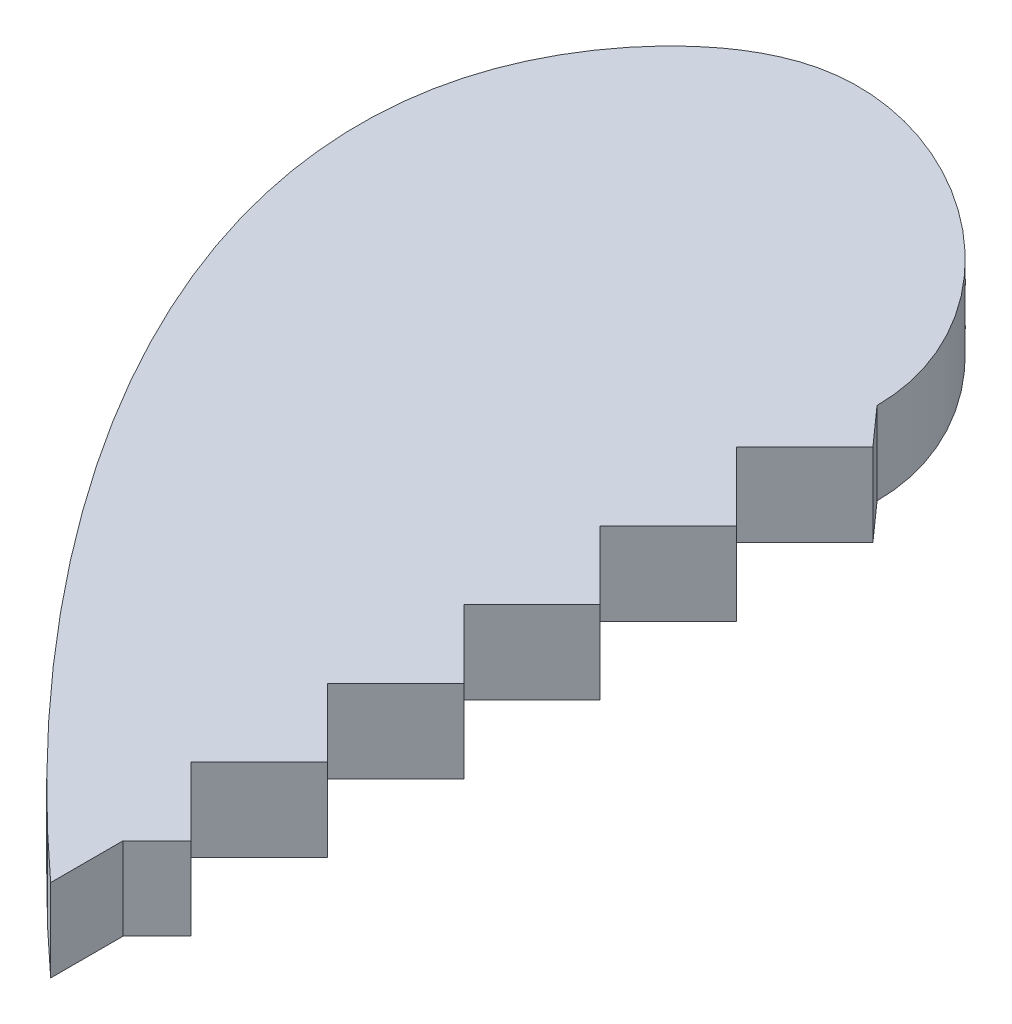
ISO-10303-21;
HEADER;
FILE_DESCRIPTION(('STEP AP214'),'2;1');
FILE_NAME('part.step','',(''),(''),'','','');
FILE_SCHEMA(('AUTOMOTIVE_DESIGN { 1 0 10303 214 1 1 1 1 }'));
ENDSEC;
DATA;
#1=APPLICATION_CONTEXT('core data for automotive mechanical design processes');
#2=APPLICATION_PROTOCOL_DEFINITION('international standard','automotive_design',2000,#1);
#3=PRODUCT_CONTEXT('',#1,'mechanical');
#4=PRODUCT('Part','Part','',(#3));
#5=PRODUCT_RELATED_PRODUCT_CATEGORY('part','',(#4));
#6=PRODUCT_DEFINITION_FORMATION('','',#4);
#7=PRODUCT_DEFINITION_CONTEXT('part definition',#1,'design');
#8=PRODUCT_DEFINITION('design','',#6,#7);
#9=PRODUCT_DEFINITION_SHAPE('','',#8);
#10=(LENGTH_UNIT() NAMED_UNIT(*) SI_UNIT(.MILLI.,.METRE.));
#11=(NAMED_UNIT(*) PLANE_ANGLE_UNIT() SI_UNIT($,.RADIAN.));
#12=(NAMED_UNIT(*) SI_UNIT($,.STERADIAN.) SOLID_ANGLE_UNIT());
#13=UNCERTAINTY_MEASURE_WITH_UNIT(LENGTH_MEASURE(1.E-05),#10,'distance_accuracy_value','');
#14=(GEOMETRIC_REPRESENTATION_CONTEXT(3) GLOBAL_UNCERTAINTY_ASSIGNED_CONTEXT((#13)) GLOBAL_UNIT_ASSIGNED_CONTEXT((#10,
#11,#12)) REPRESENTATION_CONTEXT('',''));
#15=CARTESIAN_POINT('',(0.,0.,0.));
#16=DIRECTION('',(0.,0.,1.));
#17=DIRECTION('',(1.,0.,0.));
#18=AXIS2_PLACEMENT_3D('',#15,#16,#17);
#19=CARTESIAN_POINT('',(0.,3.,-14.0721444758384));
#20=CARTESIAN_POINT('',(0.,3.,-19.24485919675));
#21=CARTESIAN_POINT('',(-9.4205206060751,3.,-26.7563747485701));
#22=CARTESIAN_POINT('',(-24.9137531388097,3.,-13.2721558044756));
#23=CARTESIAN_POINT('',(-11.5329776723601,3.,5.45462345902874));
#24=CARTESIAN_POINT('',(0.,3.,15.9278555241616));
#25=B_SPLINE_CURVE_WITH_KNOTS('',3,(#19,#20,#21,#22,#23,#24),.UNSPECIFIED.,.F.,.F.,(4,1,1,4),
(0.,0.261667033692079,0.361667033692079,1.),.UNSPECIFIED.);
#26=DIRECTION('',(0.,-1.,0.));
#27=VECTOR('',#26,1.);
#28=SURFACE_OF_LINEAR_EXTRUSION('',#25,#27);
#29=CARTESIAN_POINT('',(0.,0.,-14.0721444758384));
#30=CARTESIAN_POINT('',(0.,0.,-19.24485919675));
#31=CARTESIAN_POINT('',(-9.4205206060751,0.,-26.7563747485701));
#32=CARTESIAN_POINT('',(-24.9137531388097,0.,-13.2721558044756));
#33=CARTESIAN_POINT('',(-11.5329776723601,0.,5.45462345902874));
#34=CARTESIAN_POINT('',(0.,0.,15.9278555241616));
#35=B_SPLINE_CURVE_WITH_KNOTS('',3,(#29,#30,#31,#32,#33,#34),.UNSPECIFIED.,.F.,.F.,(4,1,1,4),
(0.,0.261667033692079,0.361667033692079,1.),.UNSPECIFIED.);
#36=CARTESIAN_POINT('',(0.,0.,-14.0721444758384));
#37=VERTEX_POINT('',#36);
#38=CARTESIAN_POINT('',(0.,0.,15.9278555241616));
#39=VERTEX_POINT('',#38);
#40=EDGE_CURVE('E231',#37,#39,#35,.T.);
#41=ORIENTED_EDGE('',*,*,#40,.T.);
#42=DIRECTION('',(0.,-1.,0.));
#43=VECTOR('',#42,1.);
#44=CARTESIAN_POINT('',(0.,3.,15.9278555241616));
#45=LINE('',#44,#43);
#46=CARTESIAN_POINT('',(0.,3.,15.9278555241616));
#47=VERTEX_POINT('',#46);
#48=EDGE_CURVE('E11',#47,#39,#45,.T.);
#49=ORIENTED_EDGE('',*,*,#48,.F.);
#50=CARTESIAN_POINT('',(0.,3.,-14.0721444758384));
#51=VERTEX_POINT('',#50);
#52=EDGE_CURVE('E260',#51,#47,#25,.T.);
#53=ORIENTED_EDGE('',*,*,#52,.F.);
#54=DIRECTION('',(0.,-1.,0.));
#55=VECTOR('',#54,1.);
#56=CARTESIAN_POINT('',(0.,3.,-14.0721444758384));
#57=LINE('',#56,#55);
#58=EDGE_CURVE('E48',#51,#37,#57,.T.);
#59=ORIENTED_EDGE('',*,*,#58,.T.);
#60=EDGE_LOOP('',(#41,#49,#53,#59));
#61=FACE_BOUND('',#60,.T.);
#62=ADVANCED_FACE('F39',(#61),#28,.F.);
#63=CARTESIAN_POINT('',(-18.2335204914853,3.,-13.3078582028131));
#64=DIRECTION('',(0.,-1.,0.));
#65=DIRECTION('',(0.,0.,-1.));
#66=AXIS2_PLACEMENT_3D('',#63,#64,#65);
#67=PLANE('',#66);
#68=ORIENTED_EDGE('',*,*,#52,.T.);
#69=DIRECTION('',(0.,0.,1.));
#70=VECTOR('',#69,1.);
#71=CARTESIAN_POINT('',(0.,3.,13.3022241949262));
#72=LINE('',#71,#70);
#73=CARTESIAN_POINT('',(0.,3.,13.3022241949262));
#74=VERTEX_POINT('',#73);
#75=EDGE_CURVE('E109',#74,#47,#72,.T.);
#76=ORIENTED_EDGE('',*,*,#75,.F.);
#77=DIRECTION('',(-0.707106781186547,0.,0.707106781186548));
#78=VECTOR('',#77,1.);
#79=CARTESIAN_POINT('',(1.23743686707646,3.,12.0647873278497));
#80=LINE('',#79,#78);
#81=CARTESIAN_POINT('',(1.23743686707646,3.,12.0647873278497));
#82=VERTEX_POINT('',#81);
#83=EDGE_CURVE('E225',#82,#74,#80,.T.);
#84=ORIENTED_EDGE('',*,*,#83,.F.);
#85=DIRECTION('',(0.707106781186547,0.,0.707106781186548));
#86=VECTOR('',#85,1.);
#87=CARTESIAN_POINT('',(-1.23743686707646,3.,9.58991359369679));
#88=LINE('',#87,#86);
#89=CARTESIAN_POINT('',(-1.23743686707646,3.,9.58991359369679));
#90=VERTEX_POINT('',#89);
#91=EDGE_CURVE('E154',#90,#82,#88,.T.);
#92=ORIENTED_EDGE('',*,*,#91,.F.);
#93=DIRECTION('',(-0.707106781186547,0.,0.707106781186548));
#94=VECTOR('',#93,1.);
#95=CARTESIAN_POINT('',(1.23743686707646,3.,7.11503985954387));
#96=LINE('',#95,#94);
#97=CARTESIAN_POINT('',(1.23743686707646,3.,7.11503985954387));
#98=VERTEX_POINT('',#97);
#99=EDGE_CURVE('E219',#98,#90,#96,.T.);
#100=ORIENTED_EDGE('',*,*,#99,.F.);
#101=DIRECTION('',(0.707106781186548,0.,0.707106781186548));
#102=VECTOR('',#101,1.);
#103=CARTESIAN_POINT('',(-1.23743686707646,3.,4.64016612539096));
#104=LINE('',#103,#102);
#105=CARTESIAN_POINT('',(-1.23743686707646,3.,4.64016612539096));
#106=VERTEX_POINT('',#105);
#107=EDGE_CURVE('E215',#106,#98,#104,.T.);
#108=ORIENTED_EDGE('',*,*,#107,.F.);
#109=DIRECTION('',(-0.707106781186547,0.,0.707106781186548));
#110=VECTOR('',#109,1.);
#111=CARTESIAN_POINT('',(1.23743686707646,3.,2.16529239123804));
#112=LINE('',#111,#110);
#113=CARTESIAN_POINT('',(1.23743686707646,3.,2.16529239123804));
#114=VERTEX_POINT('',#113);
#115=EDGE_CURVE('E211',#114,#106,#112,.T.);
#116=ORIENTED_EDGE('',*,*,#115,.F.);
#117=DIRECTION('',(0.707106781186547,0.,0.707106781186548));
#118=VECTOR('',#117,1.);
#119=CARTESIAN_POINT('',(-1.23743686707646,3.,-0.30958134291488));
#120=LINE('',#119,#118);
#121=CARTESIAN_POINT('',(-1.23743686707646,3.,-0.30958134291488));
#122=VERTEX_POINT('',#121);
#123=EDGE_CURVE('E207',#122,#114,#120,.T.);
#124=ORIENTED_EDGE('',*,*,#123,.F.);
#125=DIRECTION('',(-0.707106781186547,0.,0.707106781186547));
#126=VECTOR('',#125,1.);
#127=CARTESIAN_POINT('',(1.23743686707646,3.,-2.7844550770678));
#128=LINE('',#127,#126);
#129=CARTESIAN_POINT('',(1.23743686707646,3.,-2.7844550770678));
#130=VERTEX_POINT('',#129);
#131=EDGE_CURVE('E203',#130,#122,#128,.T.);
#132=ORIENTED_EDGE('',*,*,#131,.F.);
#133=DIRECTION('',(0.707106781186548,0.,0.707106781186548));
#134=VECTOR('',#133,1.);
#135=CARTESIAN_POINT('',(-1.23743686707646,3.,-5.25932881122071));
#136=LINE('',#135,#134);
#137=CARTESIAN_POINT('',(-1.23743686707646,3.,-5.25932881122071));
#138=VERTEX_POINT('',#137);
#139=EDGE_CURVE('E199',#138,#130,#136,.T.);
#140=ORIENTED_EDGE('',*,*,#139,.F.);
#141=DIRECTION('',(-0.707106781186548,0.,0.707106781186547));
#142=VECTOR('',#141,1.);
#143=CARTESIAN_POINT('',(1.23743686707646,3.,-7.73420254537363));
#144=LINE('',#143,#142);
#145=CARTESIAN_POINT('',(1.23743686707646,3.,-7.73420254537363));
#146=VERTEX_POINT('',#145);
#147=EDGE_CURVE('E195',#146,#138,#144,.T.);
#148=ORIENTED_EDGE('',*,*,#147,.F.);
#149=DIRECTION('',(0.707106781186548,0.,0.707106781186547));
#150=VECTOR('',#149,1.);
#151=CARTESIAN_POINT('',(-1.23743686707646,3.,-10.2090762795265));
#152=LINE('',#151,#150);
#153=CARTESIAN_POINT('',(-1.23743686707646,3.,-10.2090762795265));
#154=VERTEX_POINT('',#153);
#155=EDGE_CURVE('E191',#154,#146,#152,.T.);
#156=ORIENTED_EDGE('',*,*,#155,.F.);
#157=DIRECTION('',(-0.707106781186547,0.,0.707106781186548));
#158=VECTOR('',#157,1.);
#159=CARTESIAN_POINT('',(1.23743686707646,3.,-12.6839500136795));
#160=LINE('',#159,#158);
#161=CARTESIAN_POINT('',(1.23743686707646,3.,-12.6839500136795));
#162=VERTEX_POINT('',#161);
#163=EDGE_CURVE('E187',#162,#154,#160,.T.);
#164=ORIENTED_EDGE('',*,*,#163,.F.);
#165=DIRECTION('',(0.665410411924532,0.,0.746477718155354));
#166=VECTOR('',#165,1.);
#167=CARTESIAN_POINT('',(0.,3.,-14.0721444758384));
#168=LINE('',#167,#166);
#169=EDGE_CURVE('E183',#51,#162,#168,.T.);
#170=ORIENTED_EDGE('',*,*,#169,.F.);
#171=EDGE_LOOP('',(#68,#76,#84,#92,#100,#108,#116,#124,#132,#140,#148,#156,#164,#170));
#172=FACE_BOUND('',#171,.T.);
#173=ADVANCED_FACE('F283',(#172),#67,.F.);
#174=CARTESIAN_POINT('',(-18.2335204914853,0.,-13.3078582028131));
#175=DIRECTION('',(0.,-1.,0.));
#176=DIRECTION('',(0.,0.,-1.));
#177=AXIS2_PLACEMENT_3D('',#174,#175,#176);
#178=PLANE('',#177);
#179=DIRECTION('',(0.,0.,1.));
#180=VECTOR('',#179,1.);
#181=CARTESIAN_POINT('',(0.,0.,13.3022241949262));
#182=LINE('',#181,#180);
#183=CARTESIAN_POINT('',(0.,0.,13.3022241949262));
#184=VERTEX_POINT('',#183);
#185=EDGE_CURVE('E167',#184,#39,#182,.T.);
#186=ORIENTED_EDGE('',*,*,#185,.T.);
#187=ORIENTED_EDGE('',*,*,#40,.F.);
#188=DIRECTION('',(0.665410411924532,0.,0.746477718155354));
#189=VECTOR('',#188,1.);
#190=CARTESIAN_POINT('',(0.,0.,-14.0721444758384));
#191=LINE('',#190,#189);
#192=CARTESIAN_POINT('',(1.23743686707646,0.,-12.6839500136795));
#193=VERTEX_POINT('',#192);
#194=EDGE_CURVE('E116',#37,#193,#191,.T.);
#195=ORIENTED_EDGE('',*,*,#194,.T.);
#196=DIRECTION('',(-0.707106781186547,0.,0.707106781186548));
#197=VECTOR('',#196,1.);
#198=CARTESIAN_POINT('',(1.23743686707646,0.,-12.6839500136795));
#199=LINE('',#198,#197);
#200=CARTESIAN_POINT('',(-1.23743686707646,0.,-10.2090762795265));
#201=VERTEX_POINT('',#200);
#202=EDGE_CURVE('E55',#193,#201,#199,.T.);
#203=ORIENTED_EDGE('',*,*,#202,.T.);
#204=DIRECTION('',(0.707106781186548,0.,0.707106781186547));
#205=VECTOR('',#204,1.);
#206=CARTESIAN_POINT('',(-1.23743686707646,0.,-10.2090762795265));
#207=LINE('',#206,#205);
#208=CARTESIAN_POINT('',(1.23743686707646,0.,-7.73420254537363));
#209=VERTEX_POINT('',#208);
#210=EDGE_CURVE('E295',#201,#209,#207,.T.);
#211=ORIENTED_EDGE('',*,*,#210,.T.);
#212=DIRECTION('',(-0.707106781186548,0.,0.707106781186547));
#213=VECTOR('',#212,1.);
#214=CARTESIAN_POINT('',(1.23743686707646,0.,-7.73420254537363));
#215=LINE('',#214,#213);
#216=CARTESIAN_POINT('',(-1.23743686707646,0.,-5.25932881122071));
#217=VERTEX_POINT('',#216);
#218=EDGE_CURVE('E298',#209,#217,#215,.T.);
#219=ORIENTED_EDGE('',*,*,#218,.T.);
#220=DIRECTION('',(0.707106781186548,0.,0.707106781186548));
#221=VECTOR('',#220,1.);
#222=CARTESIAN_POINT('',(-1.23743686707646,0.,-5.25932881122071));
#223=LINE('',#222,#221);
#224=CARTESIAN_POINT('',(1.23743686707646,0.,-2.7844550770678));
#225=VERTEX_POINT('',#224);
#226=EDGE_CURVE('E307',#217,#225,#223,.T.);
#227=ORIENTED_EDGE('',*,*,#226,.T.);
#228=DIRECTION('',(-0.707106781186547,0.,0.707106781186547));
#229=VECTOR('',#228,1.);
#230=CARTESIAN_POINT('',(1.23743686707646,0.,-2.7844550770678));
#231=LINE('',#230,#229);
#232=CARTESIAN_POINT('',(-1.23743686707646,0.,-0.30958134291488));
#233=VERTEX_POINT('',#232);
#234=EDGE_CURVE('E311',#225,#233,#231,.T.);
#235=ORIENTED_EDGE('',*,*,#234,.T.);
#236=DIRECTION('',(0.707106781186547,0.,0.707106781186548));
#237=VECTOR('',#236,1.);
#238=CARTESIAN_POINT('',(-1.23743686707646,0.,-0.30958134291488));
#239=LINE('',#238,#237);
#240=CARTESIAN_POINT('',(1.23743686707646,0.,2.16529239123804));
#241=VERTEX_POINT('',#240);
#242=EDGE_CURVE('E315',#233,#241,#239,.T.);
#243=ORIENTED_EDGE('',*,*,#242,.T.);
#244=DIRECTION('',(-0.707106781186547,0.,0.707106781186548));
#245=VECTOR('',#244,1.);
#246=CARTESIAN_POINT('',(1.23743686707646,0.,2.16529239123804));
#247=LINE('',#246,#245);
#248=CARTESIAN_POINT('',(-1.23743686707646,0.,4.64016612539096));
#249=VERTEX_POINT('',#248);
#250=EDGE_CURVE('E319',#241,#249,#247,.T.);
#251=ORIENTED_EDGE('',*,*,#250,.T.);
#252=DIRECTION('',(0.707106781186548,0.,0.707106781186548));
#253=VECTOR('',#252,1.);
#254=CARTESIAN_POINT('',(-1.23743686707646,0.,4.64016612539096));
#255=LINE('',#254,#253);
#256=CARTESIAN_POINT('',(1.23743686707646,0.,7.11503985954387));
#257=VERTEX_POINT('',#256);
#258=EDGE_CURVE('E176',#249,#257,#255,.T.);
#259=ORIENTED_EDGE('',*,*,#258,.T.);
#260=DIRECTION('',(-0.707106781186547,0.,0.707106781186548));
#261=VECTOR('',#260,1.);
#262=CARTESIAN_POINT('',(1.23743686707646,0.,7.11503985954387));
#263=LINE('',#262,#261);
#264=CARTESIAN_POINT('',(-1.23743686707646,0.,9.58991359369679));
#265=VERTEX_POINT('',#264);
#266=EDGE_CURVE('E172',#257,#265,#263,.T.);
#267=ORIENTED_EDGE('',*,*,#266,.T.);
#268=DIRECTION('',(0.707106781186547,0.,0.707106781186548));
#269=VECTOR('',#268,1.);
#270=CARTESIAN_POINT('',(-1.23743686707646,0.,9.58991359369679));
#271=LINE('',#270,#269);
#272=CARTESIAN_POINT('',(1.23743686707646,0.,12.0647873278497));
#273=VERTEX_POINT('',#272);
#274=EDGE_CURVE('E151',#265,#273,#271,.T.);
#275=ORIENTED_EDGE('',*,*,#274,.T.);
#276=DIRECTION('',(-0.707106781186547,0.,0.707106781186548));
#277=VECTOR('',#276,1.);
#278=CARTESIAN_POINT('',(1.23743686707646,0.,12.0647873278497));
#279=LINE('',#278,#277);
#280=EDGE_CURVE('E163',#273,#184,#279,.T.);
#281=ORIENTED_EDGE('',*,*,#280,.T.);
#282=EDGE_LOOP('',(#186,#187,#195,#203,#211,#219,#227,#235,#243,#251,#259,#267,#275,#281));
#283=FACE_BOUND('',#282,.T.);
#284=ADVANCED_FACE('F169',(#283),#178,.T.);
#285=CARTESIAN_POINT('',(0.,0.,13.3022241949262));
#286=DIRECTION('',(-1.,0.,0.));
#287=DIRECTION('',(0.,0.,1.));
#288=AXIS2_PLACEMENT_3D('',#285,#286,#287);
#289=PLANE('',#288);
#290=ORIENTED_EDGE('',*,*,#75,.T.);
#291=ORIENTED_EDGE('',*,*,#48,.T.);
#292=ORIENTED_EDGE('',*,*,#185,.F.);
#293=DIRECTION('',(0.,1.,0.));
#294=VECTOR('',#293,1.);
#295=CARTESIAN_POINT('',(0.,0.,13.3022241949262));
#296=LINE('',#295,#294);
#297=EDGE_CURVE('E159',#184,#74,#296,.T.);
#298=ORIENTED_EDGE('',*,*,#297,.T.);
#299=EDGE_LOOP('',(#290,#291,#292,#298));
#300=FACE_BOUND('',#299,.T.);
#301=ADVANCED_FACE('F281',(#300),#289,.F.);
#302=CARTESIAN_POINT('',(1.23743686707646,0.,12.0647873278497));
#303=DIRECTION('',(-0.707106781186548,0.,-0.707106781186547));
#304=DIRECTION('',(-0.707106781186547,0.,0.707106781186548));
#305=AXIS2_PLACEMENT_3D('',#302,#303,#304);
#306=PLANE('',#305);
#307=ORIENTED_EDGE('',*,*,#83,.T.);
#308=ORIENTED_EDGE('',*,*,#297,.F.);
#309=ORIENTED_EDGE('',*,*,#280,.F.);
#310=DIRECTION('',(0.,1.,0.));
#311=VECTOR('',#310,1.);
#312=CARTESIAN_POINT('',(1.23743686707646,0.,12.0647873278497));
#313=LINE('',#312,#311);
#314=EDGE_CURVE('E147',#273,#82,#313,.T.);
#315=ORIENTED_EDGE('',*,*,#314,.T.);
#316=EDGE_LOOP('',(#307,#308,#309,#315));
#317=FACE_BOUND('',#316,.T.);
#318=ADVANCED_FACE('F164',(#317),#306,.F.);
#319=CARTESIAN_POINT('',(-1.23743686707646,0.,9.58991359369679));
#320=DIRECTION('',(-0.707106781186548,0.,0.707106781186547));
#321=DIRECTION('',(0.707106781186547,0.,0.707106781186548));
#322=AXIS2_PLACEMENT_3D('',#319,#320,#321);
#323=PLANE('',#322);
#324=ORIENTED_EDGE('',*,*,#91,.T.);
#325=ORIENTED_EDGE('',*,*,#314,.F.);
#326=ORIENTED_EDGE('',*,*,#274,.F.);
#327=DIRECTION('',(0.,1.,0.));
#328=VECTOR('',#327,1.);
#329=CARTESIAN_POINT('',(-1.23743686707646,0.,9.58991359369679));
#330=LINE('',#329,#328);
#331=EDGE_CURVE('E160',#265,#90,#330,.T.);
#332=ORIENTED_EDGE('',*,*,#331,.T.);
#333=EDGE_LOOP('',(#324,#325,#326,#332));
#334=FACE_BOUND('',#333,.T.);
#335=ADVANCED_FACE('F149',(#334),#323,.F.);
#336=CARTESIAN_POINT('',(1.23743686707646,0.,7.11503985954387));
#337=DIRECTION('',(-0.707106781186548,0.,-0.707106781186547));
#338=DIRECTION('',(-0.707106781186547,0.,0.707106781186548));
#339=AXIS2_PLACEMENT_3D('',#336,#337,#338);
#340=PLANE('',#339);
#341=ORIENTED_EDGE('',*,*,#99,.T.);
#342=ORIENTED_EDGE('',*,*,#331,.F.);
#343=ORIENTED_EDGE('',*,*,#266,.F.);
#344=DIRECTION('',(0.,1.,0.));
#345=VECTOR('',#344,1.);
#346=CARTESIAN_POINT('',(1.23743686707646,0.,7.11503985954387));
#347=LINE('',#346,#345);
#348=EDGE_CURVE('E235',#257,#98,#347,.T.);
#349=ORIENTED_EDGE('',*,*,#348,.T.);
#350=EDGE_LOOP('',(#341,#342,#343,#349));
#351=FACE_BOUND('',#350,.T.);
#352=ADVANCED_FACE('F330',(#351),#340,.F.);
#353=CARTESIAN_POINT('',(-1.23743686707646,0.,4.64016612539096));
#354=DIRECTION('',(-0.707106781186547,0.,0.707106781186547));
#355=DIRECTION('',(0.707106781186548,0.,0.707106781186548));
#356=AXIS2_PLACEMENT_3D('',#353,#354,#355);
#357=PLANE('',#356);
#358=ORIENTED_EDGE('',*,*,#107,.T.);
#359=ORIENTED_EDGE('',*,*,#348,.F.);
#360=ORIENTED_EDGE('',*,*,#258,.F.);
#361=DIRECTION('',(0.,1.,0.));
#362=VECTOR('',#361,1.);
#363=CARTESIAN_POINT('',(-1.23743686707646,0.,4.64016612539096));
#364=LINE('',#363,#362);
#365=EDGE_CURVE('E238',#249,#106,#364,.T.);
#366=ORIENTED_EDGE('',*,*,#365,.T.);
#367=EDGE_LOOP('',(#358,#359,#360,#366));
#368=FACE_BOUND('',#367,.T.);
#369=ADVANCED_FACE('F326',(#368),#357,.F.);
#370=CARTESIAN_POINT('',(1.23743686707646,0.,2.16529239123804));
#371=DIRECTION('',(-0.707106781186548,0.,-0.707106781186547));
#372=DIRECTION('',(-0.707106781186547,0.,0.707106781186548));
#373=AXIS2_PLACEMENT_3D('',#370,#371,#372);
#374=PLANE('',#373);
#375=ORIENTED_EDGE('',*,*,#115,.T.);
#376=ORIENTED_EDGE('',*,*,#365,.F.);
#377=ORIENTED_EDGE('',*,*,#250,.F.);
#378=DIRECTION('',(0.,1.,0.));
#379=VECTOR('',#378,1.);
#380=CARTESIAN_POINT('',(1.23743686707646,0.,2.16529239123804));
#381=LINE('',#380,#379);
#382=EDGE_CURVE('E241',#241,#114,#381,.T.);
#383=ORIENTED_EDGE('',*,*,#382,.T.);
#384=EDGE_LOOP('',(#375,#376,#377,#383));
#385=FACE_BOUND('',#384,.T.);
#386=ADVANCED_FACE('F335',(#385),#374,.F.);
#387=CARTESIAN_POINT('',(-1.23743686707646,0.,-0.30958134291488));
#388=DIRECTION('',(-0.707106781186548,0.,0.707106781186547));
#389=DIRECTION('',(0.707106781186547,0.,0.707106781186548));
#390=AXIS2_PLACEMENT_3D('',#387,#388,#389);
#391=PLANE('',#390);
#392=ORIENTED_EDGE('',*,*,#123,.T.);
#393=ORIENTED_EDGE('',*,*,#382,.F.);
#394=ORIENTED_EDGE('',*,*,#242,.F.);
#395=DIRECTION('',(0.,1.,0.));
#396=VECTOR('',#395,1.);
#397=CARTESIAN_POINT('',(-1.23743686707646,0.,-0.30958134291488));
#398=LINE('',#397,#396);
#399=EDGE_CURVE('E244',#233,#122,#398,.T.);
#400=ORIENTED_EDGE('',*,*,#399,.T.);
#401=EDGE_LOOP('',(#392,#393,#394,#400));
#402=FACE_BOUND('',#401,.T.);
#403=ADVANCED_FACE('F338',(#402),#391,.F.);
#404=CARTESIAN_POINT('',(1.23743686707646,0.,-2.7844550770678));
#405=DIRECTION('',(-0.707106781186548,0.,-0.707106781186548));
#406=DIRECTION('',(-0.707106781186548,0.,0.707106781186548));
#407=AXIS2_PLACEMENT_3D('',#404,#405,#406);
#408=PLANE('',#407);
#409=ORIENTED_EDGE('',*,*,#131,.T.);
#410=ORIENTED_EDGE('',*,*,#399,.F.);
#411=ORIENTED_EDGE('',*,*,#234,.F.);
#412=DIRECTION('',(0.,1.,0.));
#413=VECTOR('',#412,1.);
#414=CARTESIAN_POINT('',(1.23743686707646,0.,-2.7844550770678));
#415=LINE('',#414,#413);
#416=EDGE_CURVE('E247',#225,#130,#415,.T.);
#417=ORIENTED_EDGE('',*,*,#416,.T.);
#418=EDGE_LOOP('',(#409,#410,#411,#417));
#419=FACE_BOUND('',#418,.T.);
#420=ADVANCED_FACE('F341',(#419),#408,.F.);
#421=CARTESIAN_POINT('',(-1.23743686707646,0.,-5.25932881122071));
#422=DIRECTION('',(-0.707106781186547,0.,0.707106781186547));
#423=DIRECTION('',(0.707106781186548,0.,0.707106781186548));
#424=AXIS2_PLACEMENT_3D('',#421,#422,#423);
#425=PLANE('',#424);
#426=ORIENTED_EDGE('',*,*,#139,.T.);
#427=ORIENTED_EDGE('',*,*,#416,.F.);
#428=ORIENTED_EDGE('',*,*,#226,.F.);
#429=DIRECTION('',(0.,1.,0.));
#430=VECTOR('',#429,1.);
#431=CARTESIAN_POINT('',(-1.23743686707646,0.,-5.25932881122071));
#432=LINE('',#431,#430);
#433=EDGE_CURVE('E250',#217,#138,#432,.T.);
#434=ORIENTED_EDGE('',*,*,#433,.T.);
#435=EDGE_LOOP('',(#426,#427,#428,#434));
#436=FACE_BOUND('',#435,.T.);
#437=ADVANCED_FACE('F343',(#436),#425,.F.);
#438=CARTESIAN_POINT('',(1.23743686707646,0.,-7.73420254537363));
#439=DIRECTION('',(-0.707106781186547,0.,-0.707106781186548));
#440=DIRECTION('',(-0.707106781186548,0.,0.707106781186547));
#441=AXIS2_PLACEMENT_3D('',#438,#439,#440);
#442=PLANE('',#441);
#443=ORIENTED_EDGE('',*,*,#147,.T.);
#444=ORIENTED_EDGE('',*,*,#433,.F.);
#445=ORIENTED_EDGE('',*,*,#218,.F.);
#446=DIRECTION('',(0.,1.,0.));
#447=VECTOR('',#446,1.);
#448=CARTESIAN_POINT('',(1.23743686707646,0.,-7.73420254537363));
#449=LINE('',#448,#447);
#450=EDGE_CURVE('E253',#209,#146,#449,.T.);
#451=ORIENTED_EDGE('',*,*,#450,.T.);
#452=EDGE_LOOP('',(#443,#444,#445,#451));
#453=FACE_BOUND('',#452,.T.);
#454=ADVANCED_FACE('F346',(#453),#442,.F.);
#455=CARTESIAN_POINT('',(-1.23743686707646,0.,-10.2090762795265));
#456=DIRECTION('',(-0.707106781186547,0.,0.707106781186548));
#457=DIRECTION('',(0.707106781186548,0.,0.707106781186547));
#458=AXIS2_PLACEMENT_3D('',#455,#456,#457);
#459=PLANE('',#458);
#460=ORIENTED_EDGE('',*,*,#155,.T.);
#461=ORIENTED_EDGE('',*,*,#450,.F.);
#462=ORIENTED_EDGE('',*,*,#210,.F.);
#463=DIRECTION('',(0.,1.,0.));
#464=VECTOR('',#463,1.);
#465=CARTESIAN_POINT('',(-1.23743686707646,0.,-10.2090762795265));
#466=LINE('',#465,#464);
#467=EDGE_CURVE('E256',#201,#154,#466,.T.);
#468=ORIENTED_EDGE('',*,*,#467,.T.);
#469=EDGE_LOOP('',(#460,#461,#462,#468));
#470=FACE_BOUND('',#469,.T.);
#471=ADVANCED_FACE('F292',(#470),#459,.F.);
#472=CARTESIAN_POINT('',(1.23743686707646,0.,-12.6839500136795));
#473=DIRECTION('',(-0.707106781186548,0.,-0.707106781186547));
#474=DIRECTION('',(-0.707106781186547,0.,0.707106781186548));
#475=AXIS2_PLACEMENT_3D('',#472,#473,#474);
#476=PLANE('',#475);
#477=ORIENTED_EDGE('',*,*,#163,.T.);
#478=ORIENTED_EDGE('',*,*,#467,.F.);
#479=ORIENTED_EDGE('',*,*,#202,.F.);
#480=DIRECTION('',(0.,1.,0.));
#481=VECTOR('',#480,1.);
#482=CARTESIAN_POINT('',(1.23743686707646,0.,-12.6839500136795));
#483=LINE('',#482,#481);
#484=EDGE_CURVE('E182',#193,#162,#483,.T.);
#485=ORIENTED_EDGE('',*,*,#484,.T.);
#486=EDGE_LOOP('',(#477,#478,#479,#485));
#487=FACE_BOUND('',#486,.T.);
#488=ADVANCED_FACE('F287',(#487),#476,.F.);
#489=CARTESIAN_POINT('',(0.,0.,-14.0721444758384));
#490=DIRECTION('',(-0.746477718155354,0.,0.665410411924532));
#491=DIRECTION('',(0.665410411924532,0.,0.746477718155354));
#492=AXIS2_PLACEMENT_3D('',#489,#490,#491);
#493=PLANE('',#492);
#494=ORIENTED_EDGE('',*,*,#169,.T.);
#495=ORIENTED_EDGE('',*,*,#484,.F.);
#496=ORIENTED_EDGE('',*,*,#194,.F.);
#497=ORIENTED_EDGE('',*,*,#58,.F.);
#498=EDGE_LOOP('',(#494,#495,#496,#497));
#499=FACE_BOUND('',#498,.T.);
#500=ADVANCED_FACE('F286',(#499),#493,.F.);
#501=CLOSED_SHELL('',(#62,#173,#284,#301,#318,#335,#352,#369,#386,#403,#420,#437,#454,#471,#488,#500));
#502=MANIFOLD_SOLID_BREP('B2',#501);
#503=ADVANCED_BREP_SHAPE_REPRESENTATION('',(#18,#502),#14);
#504=SHAPE_DEFINITION_REPRESENTATION(#9,#503);
ENDSEC;
END-ISO-10303-21;
